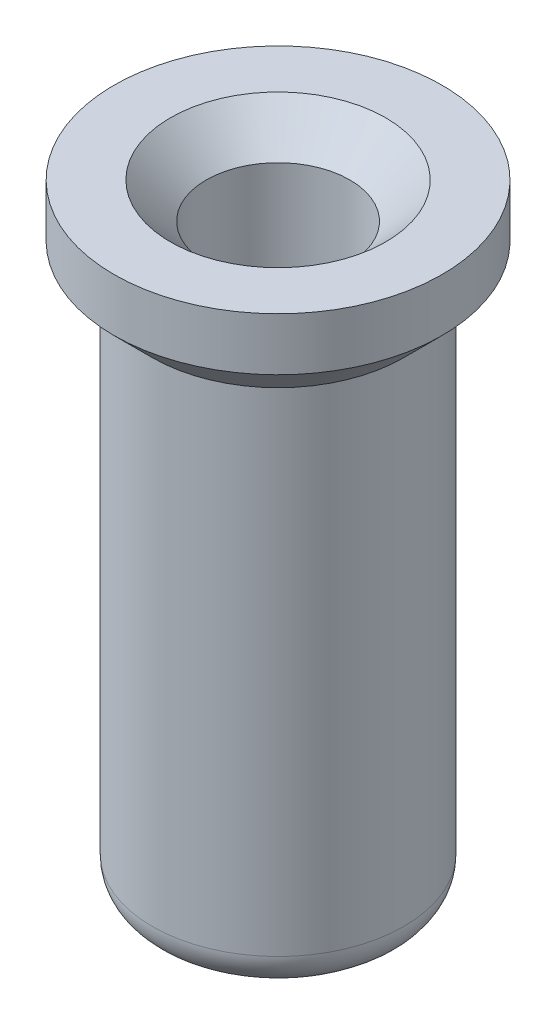
ISO-10303-21;
HEADER;
FILE_DESCRIPTION(('STEP AP214'),'2;1');
FILE_NAME('part.step','',(''),(''),'','','');
FILE_SCHEMA(('AUTOMOTIVE_DESIGN { 1 0 10303 214 1 1 1 1 }'));
ENDSEC;
DATA;
#1=APPLICATION_CONTEXT('core data for automotive mechanical design processes');
#2=APPLICATION_PROTOCOL_DEFINITION('international standard','automotive_design',2000,#1);
#3=PRODUCT_CONTEXT('',#1,'mechanical');
#4=PRODUCT('Part','Part','',(#3));
#5=PRODUCT_RELATED_PRODUCT_CATEGORY('part','',(#4));
#6=PRODUCT_DEFINITION_FORMATION('','',#4);
#7=PRODUCT_DEFINITION_CONTEXT('part definition',#1,'design');
#8=PRODUCT_DEFINITION('design','',#6,#7);
#9=PRODUCT_DEFINITION_SHAPE('','',#8);
#10=(LENGTH_UNIT() NAMED_UNIT(*) SI_UNIT(.MILLI.,.METRE.));
#11=(NAMED_UNIT(*) PLANE_ANGLE_UNIT() SI_UNIT($,.RADIAN.));
#12=(NAMED_UNIT(*) SI_UNIT($,.STERADIAN.) SOLID_ANGLE_UNIT());
#13=UNCERTAINTY_MEASURE_WITH_UNIT(LENGTH_MEASURE(1.E-05),#10,'distance_accuracy_value','');
#14=(GEOMETRIC_REPRESENTATION_CONTEXT(3) GLOBAL_UNCERTAINTY_ASSIGNED_CONTEXT((#13)) GLOBAL_UNIT_ASSIGNED_CONTEXT((#10,
#11,#12)) REPRESENTATION_CONTEXT('',''));
#15=CARTESIAN_POINT('',(0.,0.,0.));
#16=DIRECTION('',(0.,0.,1.));
#17=DIRECTION('',(1.,0.,0.));
#18=AXIS2_PLACEMENT_3D('',#15,#16,#17);
#19=CARTESIAN_POINT('',(0.,2.159,0.));
#20=DIRECTION('',(0.,-1.,0.));
#21=DIRECTION('',(0.,0.,-1.));
#22=AXIS2_PLACEMENT_3D('',#19,#20,#21);
#23=PLANE('',#22);
#24=CARTESIAN_POINT('',(0.,2.159,0.));
#25=DIRECTION('',(0.,-1.,0.));
#26=DIRECTION('',(0.,0.,-1.));
#27=AXIS2_PLACEMENT_3D('',#24,#25,#26);
#28=CIRCLE('',#27,0.75);
#29=CARTESIAN_POINT('',(0.,2.159,-0.750000000000001));
#30=VERTEX_POINT('',#29);
#31=EDGE_CURVE('E11',#30,#30,#28,.T.);
#32=ORIENTED_EDGE('',*,*,#31,.T.);
#33=EDGE_LOOP('',(#32));
#34=FACE_BOUND('',#33,.T.);
#35=CARTESIAN_POINT('',(0.,2.159,0.));
#36=DIRECTION('',(0.,1.,0.));
#37=DIRECTION('',(0.,0.,1.));
#38=AXIS2_PLACEMENT_3D('',#35,#36,#37);
#39=CIRCLE('',#38,1.143);
#40=CARTESIAN_POINT('',(0.,2.159,1.143));
#41=VERTEX_POINT('',#40);
#42=EDGE_CURVE('E69',#41,#41,#39,.T.);
#43=ORIENTED_EDGE('',*,*,#42,.T.);
#44=EDGE_LOOP('',(#43));
#45=FACE_BOUND('',#44,.T.);
#46=ADVANCED_FACE('F41',(#34,#45),#23,.F.);
#47=CARTESIAN_POINT('',(0.,2.159,0.));
#48=DIRECTION('',(0.,1.,0.));
#49=DIRECTION('',(0.,0.,1.));
#50=AXIS2_PLACEMENT_3D('',#47,#48,#49);
#51=CYLINDRICAL_SURFACE('',#50,1.143);
#52=ORIENTED_EDGE('',*,*,#42,.F.);
#53=EDGE_LOOP('',(#52));
#54=FACE_BOUND('',#53,.T.);
#55=CARTESIAN_POINT('',(0.,1.7907,0.));
#56=DIRECTION('',(0.,1.,0.));
#57=DIRECTION('',(0.,0.,1.));
#58=AXIS2_PLACEMENT_3D('',#55,#56,#57);
#59=CIRCLE('',#58,1.143);
#60=CARTESIAN_POINT('',(0.,1.7907,1.143));
#61=VERTEX_POINT('',#60);
#62=EDGE_CURVE('E64',#61,#61,#59,.T.);
#63=ORIENTED_EDGE('',*,*,#62,.T.);
#64=EDGE_LOOP('',(#63));
#65=FACE_BOUND('',#64,.T.);
#66=ADVANCED_FACE('F90',(#54,#65),#51,.T.);
#67=CARTESIAN_POINT('',(0.,1.524,0.));
#68=DIRECTION('',(0.,1.,0.));
#69=DIRECTION('',(0.,0.,1.));
#70=AXIS2_PLACEMENT_3D('',#67,#68,#69);
#71=CONICAL_SURFACE('',#70,0.8763,0.78539816339745);
#72=ORIENTED_EDGE('',*,*,#62,.F.);
#73=EDGE_LOOP('',(#72));
#74=FACE_BOUND('',#73,.T.);
#75=CARTESIAN_POINT('',(0.,1.524,0.));
#76=DIRECTION('',(0.,1.,0.));
#77=DIRECTION('',(0.,0.,1.));
#78=AXIS2_PLACEMENT_3D('',#75,#76,#77);
#79=CIRCLE('',#78,0.8763);
#80=CARTESIAN_POINT('',(0.,1.524,0.876299999999999));
#81=VERTEX_POINT('',#80);
#82=EDGE_CURVE('E61',#81,#81,#79,.T.);
#83=ORIENTED_EDGE('',*,*,#82,.T.);
#84=EDGE_LOOP('',(#83));
#85=FACE_BOUND('',#84,.T.);
#86=ADVANCED_FACE('F96',(#74,#85),#71,.T.);
#87=CARTESIAN_POINT('',(0.,2.159,0.));
#88=DIRECTION('',(0.,1.,0.));
#89=DIRECTION('',(0.,0.,1.));
#90=AXIS2_PLACEMENT_3D('',#87,#88,#89);
#91=CYLINDRICAL_SURFACE('',#90,0.876299999999999);
#92=CARTESIAN_POINT('',(0.,-1.909,0.));
#93=DIRECTION('',(0.,1.,0.));
#94=DIRECTION('',(0.,0.,1.));
#95=AXIS2_PLACEMENT_3D('',#92,#93,#94);
#96=CIRCLE('',#95,0.876299999999999);
#97=CARTESIAN_POINT('',(0.,-1.909,0.876299999999999));
#98=VERTEX_POINT('',#97);
#99=EDGE_CURVE('E72',#98,#98,#96,.T.);
#100=ORIENTED_EDGE('',*,*,#99,.T.);
#101=EDGE_LOOP('',(#100));
#102=FACE_BOUND('',#101,.T.);
#103=ORIENTED_EDGE('',*,*,#82,.F.);
#104=EDGE_LOOP('',(#103));
#105=FACE_BOUND('',#104,.T.);
#106=ADVANCED_FACE('F103',(#102,#105),#91,.T.);
#107=CARTESIAN_POINT('',(0.,-2.159,-0.8763));
#108=DIRECTION('',(0.,1.,0.));
#109=DIRECTION('',(0.,0.,1.));
#110=AXIS2_PLACEMENT_3D('',#107,#108,#109);
#111=PLANE('',#110);
#112=CARTESIAN_POINT('',(0.,-2.159,0.));
#113=DIRECTION('',(0.,1.,0.));
#114=DIRECTION('',(0.,0.,1.));
#115=AXIS2_PLACEMENT_3D('',#112,#113,#114);
#116=CIRCLE('',#115,0.626299999999999);
#117=CARTESIAN_POINT('',(0.,-2.159,0.626299999999999));
#118=VERTEX_POINT('',#117);
#119=EDGE_CURVE('E75',#118,#118,#116,.F.);
#120=ORIENTED_EDGE('',*,*,#119,.T.);
#121=EDGE_LOOP('',(#120));
#122=FACE_BOUND('',#121,.T.);
#123=ADVANCED_FACE('F55',(#122),#111,.F.);
#124=CARTESIAN_POINT('',(0.,-1.5748,0.));
#125=DIRECTION('',(0.,1.,0.));
#126=DIRECTION('',(0.,0.,1.));
#127=AXIS2_PLACEMENT_3D('',#124,#125,#126);
#128=CONICAL_SURFACE('',#127,0.499999999999999,1.02974425867665);
#129=CARTESIAN_POINT('',(0.,-1.87523030951378,0.));
#130=VERTEX_POINT('',#129);
#131=VERTEX_LOOP('',#130);
#132=FACE_BOUND('',#131,.T.);
#133=CARTESIAN_POINT('',(0.,-1.5748,0.));
#134=DIRECTION('',(0.,1.,0.));
#135=DIRECTION('',(0.,0.,1.));
#136=AXIS2_PLACEMENT_3D('',#133,#134,#135);
#137=CIRCLE('',#136,0.499999999999999);
#138=CARTESIAN_POINT('',(0.,-1.5748,0.499999999999999));
#139=VERTEX_POINT('',#138);
#140=EDGE_CURVE('E59',#139,#139,#137,.T.);
#141=ORIENTED_EDGE('',*,*,#140,.T.);
#142=EDGE_LOOP('',(#141));
#143=FACE_BOUND('',#142,.T.);
#144=ADVANCED_FACE('F51',(#132,#143),#128,.F.);
#145=CARTESIAN_POINT('',(0.,2.159,0.));
#146=DIRECTION('',(0.,1.,0.));
#147=DIRECTION('',(0.,0.,1.));
#148=AXIS2_PLACEMENT_3D('',#145,#146,#147);
#149=CYLINDRICAL_SURFACE('',#148,0.499999999999999);
#150=CARTESIAN_POINT('',(0.,1.909,0.));
#151=DIRECTION('',(0.,-1.,0.));
#152=DIRECTION('',(0.,0.,-1.));
#153=AXIS2_PLACEMENT_3D('',#150,#151,#152);
#154=CIRCLE('',#153,0.499999999999999);
#155=CARTESIAN_POINT('',(0.,1.909,-0.5));
#156=VERTEX_POINT('',#155);
#157=EDGE_CURVE('E48',#156,#156,#154,.F.);
#158=ORIENTED_EDGE('',*,*,#157,.T.);
#159=EDGE_LOOP('',(#158));
#160=FACE_BOUND('',#159,.T.);
#161=ORIENTED_EDGE('',*,*,#140,.F.);
#162=EDGE_LOOP('',(#161));
#163=FACE_BOUND('',#162,.T.);
#164=ADVANCED_FACE('F54',(#160,#163),#149,.F.);
#165=CARTESIAN_POINT('',(0.,-1.909,0.));
#166=DIRECTION('',(0.,1.,0.));
#167=DIRECTION('',(0.,0.,1.));
#168=AXIS2_PLACEMENT_3D('',#165,#166,#167);
#169=TOROIDAL_SURFACE('',#168,0.626299999999999,0.25);
#170=ORIENTED_EDGE('',*,*,#119,.F.);
#171=EDGE_LOOP('',(#170));
#172=FACE_BOUND('',#171,.T.);
#173=ORIENTED_EDGE('',*,*,#99,.F.);
#174=EDGE_LOOP('',(#173));
#175=FACE_BOUND('',#174,.T.);
#176=ADVANCED_FACE('F82',(#172,#175),#169,.T.);
#177=CARTESIAN_POINT('',(0.,1.909,0.));
#178=DIRECTION('',(0.,1.,0.));
#179=DIRECTION('',(0.,0.,1.));
#180=AXIS2_PLACEMENT_3D('',#177,#178,#179);
#181=CONICAL_SURFACE('',#180,0.499999999999999,0.785398163397449);
#182=ORIENTED_EDGE('',*,*,#31,.F.);
#183=EDGE_LOOP('',(#182));
#184=FACE_BOUND('',#183,.T.);
#185=ORIENTED_EDGE('',*,*,#157,.F.);
#186=EDGE_LOOP('',(#185));
#187=FACE_BOUND('',#186,.T.);
#188=ADVANCED_FACE('F43',(#184,#187),#181,.F.);
#189=CLOSED_SHELL('',(#46,#66,#86,#106,#123,#144,#164,#176,#188));
#190=MANIFOLD_SOLID_BREP('B2',#189);
#191=ADVANCED_BREP_SHAPE_REPRESENTATION('',(#18,#190),#14);
#192=SHAPE_DEFINITION_REPRESENTATION(#9,#191);
ENDSEC;
END-ISO-10303-21;
